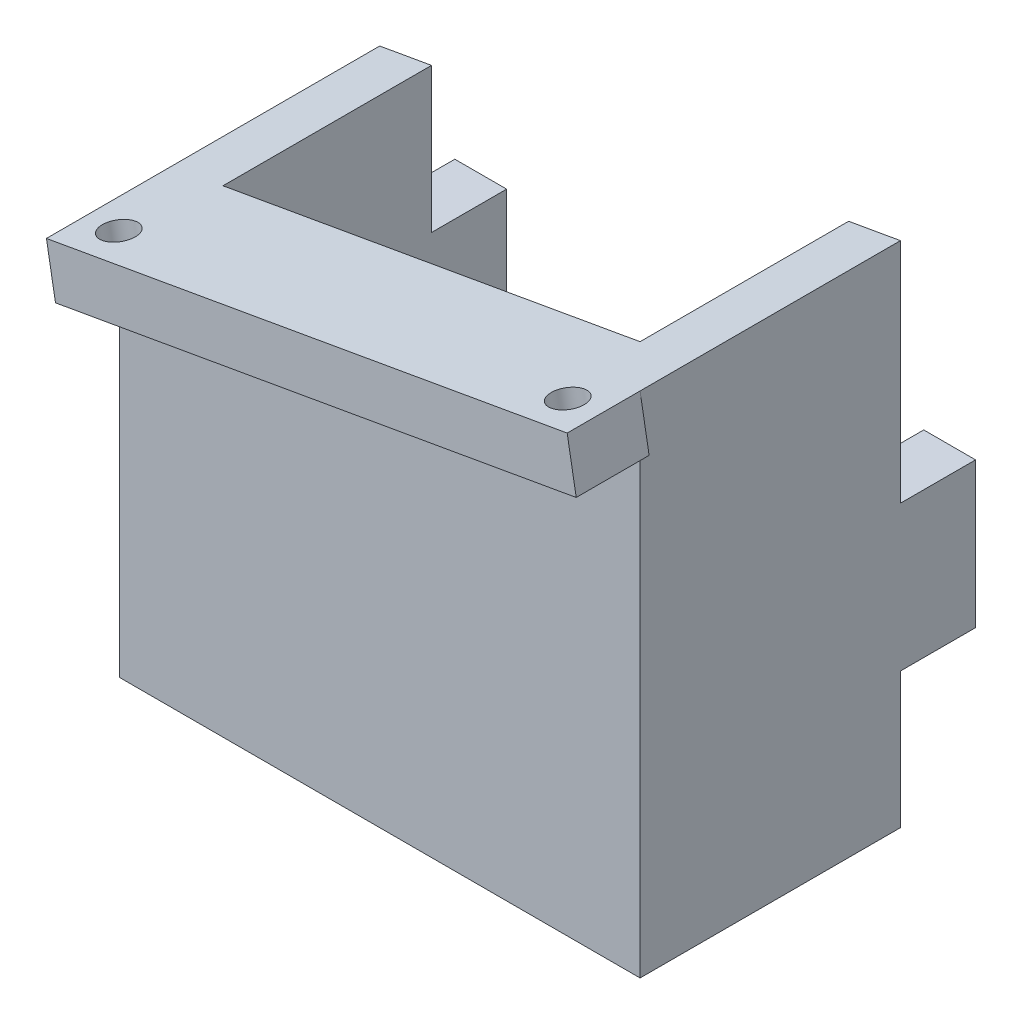
ISO-10303-21;
HEADER;
FILE_DESCRIPTION(('STEP AP214'),'2;1');
FILE_NAME('part.step','',(''),(''),'','','');
FILE_SCHEMA(('AUTOMOTIVE_DESIGN { 1 0 10303 214 1 1 1 1 }'));
ENDSEC;
DATA;
#1=APPLICATION_CONTEXT('core data for automotive mechanical design processes');
#2=APPLICATION_PROTOCOL_DEFINITION('international standard','automotive_design',2000,#1);
#3=PRODUCT_CONTEXT('',#1,'mechanical');
#4=PRODUCT('Part','Part','',(#3));
#5=PRODUCT_RELATED_PRODUCT_CATEGORY('part','',(#4));
#6=PRODUCT_DEFINITION_FORMATION('','',#4);
#7=PRODUCT_DEFINITION_CONTEXT('part definition',#1,'design');
#8=PRODUCT_DEFINITION('design','',#6,#7);
#9=PRODUCT_DEFINITION_SHAPE('','',#8);
#10=(LENGTH_UNIT() NAMED_UNIT(*) SI_UNIT(.MILLI.,.METRE.));
#11=(NAMED_UNIT(*) PLANE_ANGLE_UNIT() SI_UNIT($,.RADIAN.));
#12=(NAMED_UNIT(*) SI_UNIT($,.STERADIAN.) SOLID_ANGLE_UNIT());
#13=UNCERTAINTY_MEASURE_WITH_UNIT(LENGTH_MEASURE(1.E-05),#10,'distance_accuracy_value','');
#14=(GEOMETRIC_REPRESENTATION_CONTEXT(3) GLOBAL_UNCERTAINTY_ASSIGNED_CONTEXT((#13)) GLOBAL_UNIT_ASSIGNED_CONTEXT((#10,
#11,#12)) REPRESENTATION_CONTEXT('',''));
#15=CARTESIAN_POINT('',(0.,0.,0.));
#16=DIRECTION('',(0.,0.,1.));
#17=DIRECTION('',(1.,0.,0.));
#18=AXIS2_PLACEMENT_3D('',#15,#16,#17);
#19=CARTESIAN_POINT('',(-25.01,26.9805634136178,0.));
#20=DIRECTION('',(0.,-1.,0.));
#21=DIRECTION('',(0.,0.,-1.));
#22=AXIS2_PLACEMENT_3D('',#19,#20,#21);
#23=PLANE('',#22);
#24=DIRECTION('',(1.,0.,0.));
#25=VECTOR('',#24,1.);
#26=CARTESIAN_POINT('',(-25.01,26.9805634136178,0.));
#27=LINE('',#26,#25);
#28=CARTESIAN_POINT('',(-25.,26.9805634136178,0.));
#29=VERTEX_POINT('',#28);
#30=CARTESIAN_POINT('',(-20.025,26.9805634136178,0.));
#31=VERTEX_POINT('',#30);
#32=EDGE_CURVE('E288',#29,#31,#27,.T.);
#33=ORIENTED_EDGE('',*,*,#32,.T.);
#34=DIRECTION('',(0.,0.,-1.));
#35=VECTOR('',#34,1.);
#36=CARTESIAN_POINT('',(-20.025,26.9805634136178,20.025));
#37=LINE('',#36,#35);
#38=CARTESIAN_POINT('',(-20.025,26.9805634136178,-7.2127376350945));
#39=VERTEX_POINT('',#38);
#40=EDGE_CURVE('E297',#31,#39,#37,.T.);
#41=ORIENTED_EDGE('',*,*,#40,.T.);
#42=DIRECTION('',(1.,0.,0.));
#43=VECTOR('',#42,1.);
#44=CARTESIAN_POINT('',(-25.01,26.9805634136178,-7.2127376350945));
#45=LINE('',#44,#43);
#46=CARTESIAN_POINT('',(-25.,26.9805634136178,-7.2127376350945));
#47=VERTEX_POINT('',#46);
#48=EDGE_CURVE('E306',#47,#39,#45,.T.);
#49=ORIENTED_EDGE('',*,*,#48,.F.);
#50=DIRECTION('',(0.,0.,-1.));
#51=VECTOR('',#50,1.);
#52=CARTESIAN_POINT('',(-25.,26.9805634136178,-25.));
#53=LINE('',#52,#51);
#54=EDGE_CURVE('E41',#29,#47,#53,.T.);
#55=ORIENTED_EDGE('',*,*,#54,.F.);
#56=EDGE_LOOP('',(#33,#41,#49,#55));
#57=FACE_BOUND('',#56,.T.);
#58=ADVANCED_FACE('F37',(#57),#23,.F.);
#59=CARTESIAN_POINT('',(-25.01,26.9805634136178,-7.2127376350945));
#60=DIRECTION('',(0.,0.,1.));
#61=DIRECTION('',(1.,0.,0.));
#62=AXIS2_PLACEMENT_3D('',#59,#60,#61);
#63=PLANE('',#62);
#64=ORIENTED_EDGE('',*,*,#48,.T.);
#65=DIRECTION('',(0.,-1.,0.));
#66=VECTOR('',#65,1.);
#67=CARTESIAN_POINT('',(-20.025,110.710678118655,-7.2127376350945));
#68=LINE('',#67,#66);
#69=CARTESIAN_POINT('',(-20.025,13.0254840761523,-7.2127376350945));
#70=VERTEX_POINT('',#69);
#71=EDGE_CURVE('E295',#39,#70,#68,.T.);
#72=ORIENTED_EDGE('',*,*,#71,.T.);
#73=DIRECTION('',(1.,0.,0.));
#74=VECTOR('',#73,1.);
#75=CARTESIAN_POINT('',(-25.01,13.0254840761523,-7.2127376350945));
#76=LINE('',#75,#74);
#77=CARTESIAN_POINT('',(-25.,13.0254840761523,-7.2127376350945));
#78=VERTEX_POINT('',#77);
#79=EDGE_CURVE('E302',#78,#70,#76,.T.);
#80=ORIENTED_EDGE('',*,*,#79,.F.);
#81=DIRECTION('',(0.,-1.,0.));
#82=VECTOR('',#81,1.);
#83=CARTESIAN_POINT('',(-25.,5.,-7.2127376350945));
#84=LINE('',#83,#82);
#85=EDGE_CURVE('E346',#47,#78,#84,.T.);
#86=ORIENTED_EDGE('',*,*,#85,.F.);
#87=EDGE_LOOP('',(#64,#72,#80,#86));
#88=FACE_BOUND('',#87,.T.);
#89=ADVANCED_FACE('F421',(#88),#63,.F.);
#90=CARTESIAN_POINT('',(-25.01,13.0254840761523,-7.2127376350945));
#91=DIRECTION('',(0.,1.,0.));
#92=DIRECTION('',(0.,0.,1.));
#93=AXIS2_PLACEMENT_3D('',#90,#91,#92);
#94=PLANE('',#93);
#95=ORIENTED_EDGE('',*,*,#79,.T.);
#96=DIRECTION('',(0.,0.,1.));
#97=VECTOR('',#96,1.);
#98=CARTESIAN_POINT('',(-20.025,13.0254840761523,20.025));
#99=LINE('',#98,#97);
#100=CARTESIAN_POINT('',(-20.025,13.0254840761523,0.));
#101=VERTEX_POINT('',#100);
#102=EDGE_CURVE('E293',#70,#101,#99,.T.);
#103=ORIENTED_EDGE('',*,*,#102,.T.);
#104=DIRECTION('',(1.,0.,0.));
#105=VECTOR('',#104,1.);
#106=CARTESIAN_POINT('',(-25.01,13.0254840761523,0.));
#107=LINE('',#106,#105);
#108=CARTESIAN_POINT('',(-25.,13.0254840761523,0.));
#109=VERTEX_POINT('',#108);
#110=EDGE_CURVE('E46',#109,#101,#107,.T.);
#111=ORIENTED_EDGE('',*,*,#110,.F.);
#112=DIRECTION('',(0.,0.,1.));
#113=VECTOR('',#112,1.);
#114=CARTESIAN_POINT('',(-25.,13.0254840761523,-25.));
#115=LINE('',#114,#113);
#116=EDGE_CURVE('E333',#78,#109,#115,.T.);
#117=ORIENTED_EDGE('',*,*,#116,.F.);
#118=EDGE_LOOP('',(#95,#103,#111,#117));
#119=FACE_BOUND('',#118,.T.);
#120=ADVANCED_FACE('F426',(#119),#94,.F.);
#121=CARTESIAN_POINT('',(-25.01,13.0254840761523,0.));
#122=DIRECTION('',(0.,0.,1.));
#123=DIRECTION('',(1.,0.,0.));
#124=AXIS2_PLACEMENT_3D('',#121,#122,#123);
#125=PLANE('',#124);
#126=ORIENTED_EDGE('',*,*,#110,.T.);
#127=DIRECTION('',(0.,-1.,0.));
#128=VECTOR('',#127,1.);
#129=CARTESIAN_POINT('',(-20.025,110.710678118655,0.));
#130=LINE('',#129,#128);
#131=CARTESIAN_POINT('',(-20.025,5.,0.));
#132=VERTEX_POINT('',#131);
#133=EDGE_CURVE('E290',#101,#132,#130,.T.);
#134=ORIENTED_EDGE('',*,*,#133,.T.);
#135=DIRECTION('',(-1.,0.,0.));
#136=VECTOR('',#135,1.);
#137=CARTESIAN_POINT('',(0.,5.,0.));
#138=LINE('',#137,#136);
#139=CARTESIAN_POINT('',(-18.025,5.,0.));
#140=VERTEX_POINT('',#139);
#141=EDGE_CURVE('E322',#140,#132,#138,.T.);
#142=ORIENTED_EDGE('',*,*,#141,.F.);
#143=DIRECTION('',(0.,-1.,0.));
#144=VECTOR('',#143,1.);
#145=CARTESIAN_POINT('',(-18.025,5.,0.));
#146=LINE('',#145,#144);
#147=CARTESIAN_POINT('',(-18.025,0.,0.));
#148=VERTEX_POINT('',#147);
#149=EDGE_CURVE('E326',#140,#148,#146,.T.);
#150=ORIENTED_EDGE('',*,*,#149,.T.);
#151=DIRECTION('',(-1.,0.,0.));
#152=VECTOR('',#151,1.);
#153=CARTESIAN_POINT('',(0.,0.,0.));
#154=LINE('',#153,#152);
#155=CARTESIAN_POINT('',(-25.,0.,0.));
#156=VERTEX_POINT('',#155);
#157=EDGE_CURVE('E329',#148,#156,#154,.T.);
#158=ORIENTED_EDGE('',*,*,#157,.T.);
#159=DIRECTION('',(0.,-1.,0.));
#160=VECTOR('',#159,1.);
#161=CARTESIAN_POINT('',(-25.,5.,0.));
#162=LINE('',#161,#160);
#163=EDGE_CURVE('E315',#109,#156,#162,.T.);
#164=ORIENTED_EDGE('',*,*,#163,.F.);
#165=EDGE_LOOP('',(#126,#134,#142,#150,#158,#164));
#166=FACE_BOUND('',#165,.T.);
#167=ADVANCED_FACE('F451',(#166),#125,.F.);
#168=CARTESIAN_POINT('',(-25.01,51.2843532710014,0.));
#169=DIRECTION('',(0.,0.,1.));
#170=DIRECTION('',(1.,0.,0.));
#171=AXIS2_PLACEMENT_3D('',#168,#169,#170);
#172=PLANE('',#171);
#173=DIRECTION('',(0.984807749763281,0.17364819609251,0.));
#174=VECTOR('',#173,1.);
#175=CARTESIAN_POINT('',(-7.59424596992729,43.0691043908606,0.));
#176=LINE('',#175,#174);
#177=CARTESIAN_POINT('',(-25.,40.,0.));
#178=VERTEX_POINT('',#177);
#179=CARTESIAN_POINT('',(-20.025,40.877226825,0.));
#180=VERTEX_POINT('',#179);
#181=EDGE_CURVE('E289',#178,#180,#176,.T.);
#182=ORIENTED_EDGE('',*,*,#181,.T.);
#183=DIRECTION('',(0.,-1.,0.));
#184=VECTOR('',#183,1.);
#185=CARTESIAN_POINT('',(-20.025,110.710678118655,0.));
#186=LINE('',#185,#184);
#187=EDGE_CURVE('E54',#180,#31,#186,.T.);
#188=ORIENTED_EDGE('',*,*,#187,.T.);
#189=ORIENTED_EDGE('',*,*,#32,.F.);
#190=DIRECTION('',(0.,-1.,0.));
#191=VECTOR('',#190,1.);
#192=CARTESIAN_POINT('',(-25.,5.,0.));
#193=LINE('',#192,#191);
#194=EDGE_CURVE('E319',#178,#29,#193,.T.);
#195=ORIENTED_EDGE('',*,*,#194,.F.);
#196=EDGE_LOOP('',(#182,#188,#189,#195));
#197=FACE_BOUND('',#196,.T.);
#198=ADVANCED_FACE('F39',(#197),#172,.F.);
#199=CARTESIAN_POINT('',(20.025,26.9805634136178,0.));
#200=VERTEX_POINT('',#199);
#201=CARTESIAN_POINT('',(25.,26.9805634136178,0.));
#202=VERTEX_POINT('',#201);
#203=EDGE_CURVE('E307',#200,#202,#27,.T.);
#204=ORIENTED_EDGE('',*,*,#203,.F.);
#205=DIRECTION('',(0.,1.,0.));
#206=VECTOR('',#205,1.);
#207=CARTESIAN_POINT('',(20.025,110.710678118655,0.));
#208=LINE('',#207,#206);
#209=CARTESIAN_POINT('',(20.025,47.939123175,0.));
#210=VERTEX_POINT('',#209);
#211=EDGE_CURVE('E310',#200,#210,#208,.T.);
#212=ORIENTED_EDGE('',*,*,#211,.T.);
#213=CARTESIAN_POINT('',(25.,48.81635,0.));
#214=VERTEX_POINT('',#213);
#215=EDGE_CURVE('E62',#210,#214,#176,.T.);
#216=ORIENTED_EDGE('',*,*,#215,.T.);
#217=DIRECTION('',(0.,1.,0.));
#218=VECTOR('',#217,1.);
#219=CARTESIAN_POINT('',(25.,5.,0.));
#220=LINE('',#219,#218);
#221=EDGE_CURVE('E233',#202,#214,#220,.T.);
#222=ORIENTED_EDGE('',*,*,#221,.F.);
#223=EDGE_LOOP('',(#204,#212,#216,#222));
#224=FACE_BOUND('',#223,.T.);
#225=ADVANCED_FACE('F359',(#224),#172,.F.);
#226=CARTESIAN_POINT('',(25.,0.,0.));
#227=VERTEX_POINT('',#226);
#228=CARTESIAN_POINT('',(18.025,0.,0.));
#229=VERTEX_POINT('',#228);
#230=EDGE_CURVE('E325',#227,#229,#154,.T.);
#231=ORIENTED_EDGE('',*,*,#230,.T.);
#232=DIRECTION('',(0.,1.,0.));
#233=VECTOR('',#232,1.);
#234=CARTESIAN_POINT('',(18.025,5.,0.));
#235=LINE('',#234,#233);
#236=CARTESIAN_POINT('',(18.025,5.,0.));
#237=VERTEX_POINT('',#236);
#238=EDGE_CURVE('E313',#229,#237,#235,.T.);
#239=ORIENTED_EDGE('',*,*,#238,.T.);
#240=CARTESIAN_POINT('',(20.025,5.,0.));
#241=VERTEX_POINT('',#240);
#242=EDGE_CURVE('E323',#241,#237,#138,.T.);
#243=ORIENTED_EDGE('',*,*,#242,.F.);
#244=DIRECTION('',(0.,1.,0.));
#245=VECTOR('',#244,1.);
#246=CARTESIAN_POINT('',(20.025,110.710678118655,0.));
#247=LINE('',#246,#245);
#248=CARTESIAN_POINT('',(20.025,13.0254840761523,0.));
#249=VERTEX_POINT('',#248);
#250=EDGE_CURVE('E318',#241,#249,#247,.T.);
#251=ORIENTED_EDGE('',*,*,#250,.T.);
#252=CARTESIAN_POINT('',(25.,13.0254840761523,0.));
#253=VERTEX_POINT('',#252);
#254=EDGE_CURVE('E11',#249,#253,#107,.T.);
#255=ORIENTED_EDGE('',*,*,#254,.T.);
#256=DIRECTION('',(0.,1.,0.));
#257=VECTOR('',#256,1.);
#258=CARTESIAN_POINT('',(25.,5.,0.));
#259=LINE('',#258,#257);
#260=EDGE_CURVE('E338',#227,#253,#259,.T.);
#261=ORIENTED_EDGE('',*,*,#260,.F.);
#262=EDGE_LOOP('',(#231,#239,#243,#251,#255,#261));
#263=FACE_BOUND('',#262,.T.);
#264=ADVANCED_FACE('F445',(#263),#125,.F.);
#265=ORIENTED_EDGE('',*,*,#254,.F.);
#266=DIRECTION('',(0.,0.,-1.));
#267=VECTOR('',#266,1.);
#268=CARTESIAN_POINT('',(20.025,13.0254840761523,20.025));
#269=LINE('',#268,#267);
#270=CARTESIAN_POINT('',(20.025,13.0254840761523,-7.2127376350945));
#271=VERTEX_POINT('',#270);
#272=EDGE_CURVE('E335',#249,#271,#269,.T.);
#273=ORIENTED_EDGE('',*,*,#272,.T.);
#274=CARTESIAN_POINT('',(25.,13.0254840761523,-7.2127376350945));
#275=VERTEX_POINT('',#274);
#276=EDGE_CURVE('E299',#271,#275,#76,.T.);
#277=ORIENTED_EDGE('',*,*,#276,.T.);
#278=DIRECTION('',(0.,0.,-1.));
#279=VECTOR('',#278,1.);
#280=CARTESIAN_POINT('',(25.,13.0254840761523,-25.));
#281=LINE('',#280,#279);
#282=EDGE_CURVE('E340',#253,#275,#281,.T.);
#283=ORIENTED_EDGE('',*,*,#282,.F.);
#284=EDGE_LOOP('',(#265,#273,#277,#283));
#285=FACE_BOUND('',#284,.T.);
#286=ADVANCED_FACE('F440',(#285),#94,.F.);
#287=ORIENTED_EDGE('',*,*,#276,.F.);
#288=DIRECTION('',(0.,1.,0.));
#289=VECTOR('',#288,1.);
#290=CARTESIAN_POINT('',(20.025,110.710678118655,-7.2127376350945));
#291=LINE('',#290,#289);
#292=CARTESIAN_POINT('',(20.025,26.9805634136178,-7.2127376350945));
#293=VERTEX_POINT('',#292);
#294=EDGE_CURVE('E342',#271,#293,#291,.T.);
#295=ORIENTED_EDGE('',*,*,#294,.T.);
#296=CARTESIAN_POINT('',(25.,26.9805634136178,-7.2127376350945));
#297=VERTEX_POINT('',#296);
#298=EDGE_CURVE('E303',#293,#297,#45,.T.);
#299=ORIENTED_EDGE('',*,*,#298,.T.);
#300=DIRECTION('',(0.,1.,0.));
#301=VECTOR('',#300,1.);
#302=CARTESIAN_POINT('',(25.,5.,-7.2127376350945));
#303=LINE('',#302,#301);
#304=EDGE_CURVE('E344',#275,#297,#303,.T.);
#305=ORIENTED_EDGE('',*,*,#304,.F.);
#306=EDGE_LOOP('',(#287,#295,#299,#305));
#307=FACE_BOUND('',#306,.T.);
#308=ADVANCED_FACE('F429',(#307),#63,.F.);
#309=ORIENTED_EDGE('',*,*,#298,.F.);
#310=DIRECTION('',(0.,0.,1.));
#311=VECTOR('',#310,1.);
#312=CARTESIAN_POINT('',(20.025,26.9805634136178,20.025));
#313=LINE('',#312,#311);
#314=EDGE_CURVE('E312',#293,#200,#313,.T.);
#315=ORIENTED_EDGE('',*,*,#314,.T.);
#316=ORIENTED_EDGE('',*,*,#203,.T.);
#317=DIRECTION('',(0.,0.,1.));
#318=VECTOR('',#317,1.);
#319=CARTESIAN_POINT('',(25.,26.9805634136178,-25.));
#320=LINE('',#319,#318);
#321=EDGE_CURVE('E316',#297,#202,#320,.T.);
#322=ORIENTED_EDGE('',*,*,#321,.F.);
#323=EDGE_LOOP('',(#309,#315,#316,#322));
#324=FACE_BOUND('',#323,.T.);
#325=ADVANCED_FACE('F356',(#324),#23,.F.);
#326=CARTESIAN_POINT('',(0.,5.,0.));
#327=DIRECTION('',(0.,-1.,0.));
#328=DIRECTION('',(0.,0.,-1.));
#329=AXIS2_PLACEMENT_3D('',#326,#327,#328);
#330=PLANE('',#329);
#331=DIRECTION('',(0.,0.,-1.));
#332=VECTOR('',#331,1.);
#333=CARTESIAN_POINT('',(20.025,5.,0.));
#334=LINE('',#333,#332);
#335=CARTESIAN_POINT('',(20.025,5.,20.025));
#336=VERTEX_POINT('',#335);
#337=EDGE_CURVE('E253',#336,#241,#334,.T.);
#338=ORIENTED_EDGE('',*,*,#337,.T.);
#339=ORIENTED_EDGE('',*,*,#242,.T.);
#340=DIRECTION('',(0.,0.,-1.));
#341=VECTOR('',#340,1.);
#342=CARTESIAN_POINT('',(18.025,5.,-18.025));
#343=LINE('',#342,#341);
#344=CARTESIAN_POINT('',(18.025,5.,18.025));
#345=VERTEX_POINT('',#344);
#346=EDGE_CURVE('E262',#345,#237,#343,.T.);
#347=ORIENTED_EDGE('',*,*,#346,.F.);
#348=DIRECTION('',(1.,0.,0.));
#349=VECTOR('',#348,1.);
#350=CARTESIAN_POINT('',(18.025,5.,18.025));
#351=LINE('',#350,#349);
#352=CARTESIAN_POINT('',(-18.025,5.,18.025));
#353=VERTEX_POINT('',#352);
#354=EDGE_CURVE('E259',#353,#345,#351,.T.);
#355=ORIENTED_EDGE('',*,*,#354,.F.);
#356=DIRECTION('',(0.,0.,1.));
#357=VECTOR('',#356,1.);
#358=CARTESIAN_POINT('',(-18.025,5.,-18.025));
#359=LINE('',#358,#357);
#360=EDGE_CURVE('E257',#140,#353,#359,.T.);
#361=ORIENTED_EDGE('',*,*,#360,.F.);
#362=ORIENTED_EDGE('',*,*,#141,.T.);
#363=DIRECTION('',(0.,0.,1.));
#364=VECTOR('',#363,1.);
#365=CARTESIAN_POINT('',(-20.025,5.,0.));
#366=LINE('',#365,#364);
#367=CARTESIAN_POINT('',(-20.025,5.,20.025));
#368=VERTEX_POINT('',#367);
#369=EDGE_CURVE('E248',#132,#368,#366,.T.);
#370=ORIENTED_EDGE('',*,*,#369,.T.);
#371=DIRECTION('',(1.,0.,0.));
#372=VECTOR('',#371,1.);
#373=CARTESIAN_POINT('',(0.,5.,20.025));
#374=LINE('',#373,#372);
#375=EDGE_CURVE('E250',#368,#336,#374,.T.);
#376=ORIENTED_EDGE('',*,*,#375,.T.);
#377=EDGE_LOOP('',(#338,#339,#347,#355,#361,#362,#370,#376));
#378=FACE_BOUND('',#377,.T.);
#379=ADVANCED_FACE('F432',(#378),#330,.F.);
#380=CARTESIAN_POINT('',(0.,0.,0.));
#381=DIRECTION('',(0.,-1.,0.));
#382=DIRECTION('',(0.,0.,-1.));
#383=AXIS2_PLACEMENT_3D('',#380,#381,#382);
#384=PLANE('',#383);
#385=ORIENTED_EDGE('',*,*,#230,.F.);
#386=DIRECTION('',(0.,0.,-1.));
#387=VECTOR('',#386,1.);
#388=CARTESIAN_POINT('',(25.,0.,-25.));
#389=LINE('',#388,#387);
#390=CARTESIAN_POINT('',(25.,0.,25.));
#391=VERTEX_POINT('',#390);
#392=EDGE_CURVE('E281',#391,#227,#389,.T.);
#393=ORIENTED_EDGE('',*,*,#392,.F.);
#394=DIRECTION('',(1.,0.,0.));
#395=VECTOR('',#394,1.);
#396=CARTESIAN_POINT('',(25.,0.,25.));
#397=LINE('',#396,#395);
#398=CARTESIAN_POINT('',(-25.,0.,25.));
#399=VERTEX_POINT('',#398);
#400=EDGE_CURVE('E278',#399,#391,#397,.T.);
#401=ORIENTED_EDGE('',*,*,#400,.F.);
#402=DIRECTION('',(0.,0.,1.));
#403=VECTOR('',#402,1.);
#404=CARTESIAN_POINT('',(-25.,0.,-25.));
#405=LINE('',#404,#403);
#406=EDGE_CURVE('E276',#156,#399,#405,.T.);
#407=ORIENTED_EDGE('',*,*,#406,.F.);
#408=ORIENTED_EDGE('',*,*,#157,.F.);
#409=DIRECTION('',(0.,0.,1.));
#410=VECTOR('',#409,1.);
#411=CARTESIAN_POINT('',(-18.025,0.,-18.025));
#412=LINE('',#411,#410);
#413=CARTESIAN_POINT('',(-18.025,0.,18.025));
#414=VERTEX_POINT('',#413);
#415=EDGE_CURVE('E256',#148,#414,#412,.T.);
#416=ORIENTED_EDGE('',*,*,#415,.T.);
#417=DIRECTION('',(1.,0.,0.));
#418=VECTOR('',#417,1.);
#419=CARTESIAN_POINT('',(18.025,0.,18.025));
#420=LINE('',#419,#418);
#421=CARTESIAN_POINT('',(18.025,0.,18.025));
#422=VERTEX_POINT('',#421);
#423=EDGE_CURVE('E267',#414,#422,#420,.T.);
#424=ORIENTED_EDGE('',*,*,#423,.T.);
#425=DIRECTION('',(0.,0.,-1.));
#426=VECTOR('',#425,1.);
#427=CARTESIAN_POINT('',(18.025,0.,-18.025));
#428=LINE('',#427,#426);
#429=EDGE_CURVE('E260',#422,#229,#428,.T.);
#430=ORIENTED_EDGE('',*,*,#429,.T.);
#431=EDGE_LOOP('',(#385,#393,#401,#407,#408,#416,#424,#430));
#432=FACE_BOUND('',#431,.T.);
#433=ADVANCED_FACE('F437',(#432),#384,.T.);
#434=CARTESIAN_POINT('',(-25.,5.,-25.));
#435=DIRECTION('',(1.,0.,0.));
#436=DIRECTION('',(0.,0.,-1.));
#437=AXIS2_PLACEMENT_3D('',#434,#435,#436);
#438=PLANE('',#437);
#439=DIRECTION('',(0.,0.,1.));
#440=VECTOR('',#439,1.);
#441=CARTESIAN_POINT('',(-25.,40.,25.));
#442=LINE('',#441,#440);
#443=CARTESIAN_POINT('',(-25.,40.,25.));
#444=VERTEX_POINT('',#443);
#445=EDGE_CURVE('E234',#178,#444,#442,.T.);
#446=ORIENTED_EDGE('',*,*,#445,.F.);
#447=ORIENTED_EDGE('',*,*,#194,.T.);
#448=ORIENTED_EDGE('',*,*,#54,.T.);
#449=ORIENTED_EDGE('',*,*,#85,.T.);
#450=ORIENTED_EDGE('',*,*,#116,.T.);
#451=ORIENTED_EDGE('',*,*,#163,.T.);
#452=ORIENTED_EDGE('',*,*,#406,.T.);
#453=DIRECTION('',(0.,-1.,0.));
#454=VECTOR('',#453,1.);
#455=CARTESIAN_POINT('',(-25.,5.,25.));
#456=LINE('',#455,#454);
#457=EDGE_CURVE('E208',#444,#399,#456,.T.);
#458=ORIENTED_EDGE('',*,*,#457,.F.);
#459=EDGE_LOOP('',(#446,#447,#448,#449,#450,#451,#452,#458));
#460=FACE_BOUND('',#459,.T.);
#461=ADVANCED_FACE('F456',(#460),#438,.F.);
#462=CARTESIAN_POINT('',(25.,5.,25.));
#463=DIRECTION('',(0.,0.,-1.));
#464=DIRECTION('',(-1.,0.,0.));
#465=AXIS2_PLACEMENT_3D('',#462,#463,#464);
#466=PLANE('',#465);
#467=DIRECTION('',(0.,-1.,0.));
#468=VECTOR('',#467,1.);
#469=CARTESIAN_POINT('',(25.,5.,25.));
#470=LINE('',#469,#468);
#471=CARTESIAN_POINT('',(25.,43.7392169238216,25.));
#472=VERTEX_POINT('',#471);
#473=EDGE_CURVE('E209',#472,#391,#470,.T.);
#474=ORIENTED_EDGE('',*,*,#473,.F.);
#475=DIRECTION('',(-0.984807749763281,-0.17364819609251,0.));
#476=VECTOR('',#475,1.);
#477=CARTESIAN_POINT('',(-24.1317590195375,35.0759612511836,25.));
#478=LINE('',#477,#476);
#479=CARTESIAN_POINT('',(-24.1317590195375,35.0759612511836,25.));
#480=VERTEX_POINT('',#479);
#481=EDGE_CURVE('E286',#472,#480,#478,.T.);
#482=ORIENTED_EDGE('',*,*,#481,.T.);
#483=DIRECTION('',(-0.17364819609251,0.984807749763281,0.));
#484=VECTOR('',#483,1.);
#485=CARTESIAN_POINT('',(-24.1317590195375,35.0759612511836,25.));
#486=LINE('',#485,#484);
#487=EDGE_CURVE('E377',#480,#444,#486,.T.);
#488=ORIENTED_EDGE('',*,*,#487,.T.);
#489=ORIENTED_EDGE('',*,*,#457,.T.);
#490=ORIENTED_EDGE('',*,*,#400,.T.);
#491=EDGE_LOOP('',(#474,#482,#488,#489,#490));
#492=FACE_BOUND('',#491,.T.);
#493=ADVANCED_FACE('F459',(#492),#466,.F.);
#494=CARTESIAN_POINT('',(25.,5.,-25.));
#495=DIRECTION('',(-1.,0.,0.));
#496=DIRECTION('',(0.,0.,1.));
#497=AXIS2_PLACEMENT_3D('',#494,#495,#496);
#498=PLANE('',#497);
#499=ORIENTED_EDGE('',*,*,#321,.T.);
#500=ORIENTED_EDGE('',*,*,#221,.T.);
#501=DIRECTION('',(0.,0.,-1.));
#502=VECTOR('',#501,1.);
#503=CARTESIAN_POINT('',(25.,48.81635,25.));
#504=LINE('',#503,#502);
#505=CARTESIAN_POINT('',(25.,48.81635,25.));
#506=VERTEX_POINT('',#505);
#507=EDGE_CURVE('E226',#506,#214,#504,.T.);
#508=ORIENTED_EDGE('',*,*,#507,.F.);
#509=EDGE_CURVE('E199',#506,#472,#470,.T.);
#510=ORIENTED_EDGE('',*,*,#509,.T.);
#511=ORIENTED_EDGE('',*,*,#473,.T.);
#512=ORIENTED_EDGE('',*,*,#392,.T.);
#513=ORIENTED_EDGE('',*,*,#260,.T.);
#514=ORIENTED_EDGE('',*,*,#282,.T.);
#515=ORIENTED_EDGE('',*,*,#304,.T.);
#516=EDGE_LOOP('',(#499,#500,#508,#510,#511,#512,#513,#514,#515));
#517=FACE_BOUND('',#516,.T.);
#518=ADVANCED_FACE('F232',(#517),#498,.F.);
#519=CARTESIAN_POINT('',(-18.025,5.,-18.025));
#520=DIRECTION('',(1.,0.,0.));
#521=DIRECTION('',(0.,0.,-1.));
#522=AXIS2_PLACEMENT_3D('',#519,#520,#521);
#523=PLANE('',#522);
#524=ORIENTED_EDGE('',*,*,#149,.F.);
#525=ORIENTED_EDGE('',*,*,#360,.T.);
#526=DIRECTION('',(0.,-1.,0.));
#527=VECTOR('',#526,1.);
#528=CARTESIAN_POINT('',(-18.025,5.,18.025));
#529=LINE('',#528,#527);
#530=EDGE_CURVE('E273',#353,#414,#529,.T.);
#531=ORIENTED_EDGE('',*,*,#530,.T.);
#532=ORIENTED_EDGE('',*,*,#415,.F.);
#533=EDGE_LOOP('',(#524,#525,#531,#532));
#534=FACE_BOUND('',#533,.T.);
#535=ADVANCED_FACE('F466',(#534),#523,.T.);
#536=CARTESIAN_POINT('',(18.025,5.,18.025));
#537=DIRECTION('',(0.,0.,-1.));
#538=DIRECTION('',(-1.,0.,0.));
#539=AXIS2_PLACEMENT_3D('',#536,#537,#538);
#540=PLANE('',#539);
#541=ORIENTED_EDGE('',*,*,#423,.F.);
#542=ORIENTED_EDGE('',*,*,#530,.F.);
#543=ORIENTED_EDGE('',*,*,#354,.T.);
#544=DIRECTION('',(0.,-1.,0.));
#545=VECTOR('',#544,1.);
#546=CARTESIAN_POINT('',(18.025,5.,18.025));
#547=LINE('',#546,#545);
#548=EDGE_CURVE('E265',#345,#422,#547,.T.);
#549=ORIENTED_EDGE('',*,*,#548,.T.);
#550=EDGE_LOOP('',(#541,#542,#543,#549));
#551=FACE_BOUND('',#550,.T.);
#552=ADVANCED_FACE('F472',(#551),#540,.T.);
#553=CARTESIAN_POINT('',(18.025,5.,-18.025));
#554=DIRECTION('',(-1.,0.,0.));
#555=DIRECTION('',(0.,0.,1.));
#556=AXIS2_PLACEMENT_3D('',#553,#554,#555);
#557=PLANE('',#556);
#558=ORIENTED_EDGE('',*,*,#238,.F.);
#559=ORIENTED_EDGE('',*,*,#429,.F.);
#560=ORIENTED_EDGE('',*,*,#548,.F.);
#561=ORIENTED_EDGE('',*,*,#346,.T.);
#562=EDGE_LOOP('',(#558,#559,#560,#561));
#563=FACE_BOUND('',#562,.T.);
#564=ADVANCED_FACE('F476',(#563),#557,.T.);
#565=CARTESIAN_POINT('',(20.025,110.710678118655,20.025));
#566=DIRECTION('',(-1.,0.,0.));
#567=DIRECTION('',(0.,0.,1.));
#568=AXIS2_PLACEMENT_3D('',#565,#566,#567);
#569=PLANE('',#568);
#570=ORIENTED_EDGE('',*,*,#211,.F.);
#571=ORIENTED_EDGE('',*,*,#314,.F.);
#572=ORIENTED_EDGE('',*,*,#294,.F.);
#573=ORIENTED_EDGE('',*,*,#272,.F.);
#574=ORIENTED_EDGE('',*,*,#250,.F.);
#575=ORIENTED_EDGE('',*,*,#337,.F.);
#576=DIRECTION('',(0.,-1.,0.));
#577=VECTOR('',#576,1.);
#578=CARTESIAN_POINT('',(20.025,110.710678118655,20.025));
#579=LINE('',#578,#577);
#580=CARTESIAN_POINT('',(20.025,47.939123175,20.025));
#581=VERTEX_POINT('',#580);
#582=EDGE_CURVE('E237',#581,#336,#579,.T.);
#583=ORIENTED_EDGE('',*,*,#582,.F.);
#584=DIRECTION('',(0.,0.,-1.));
#585=VECTOR('',#584,1.);
#586=CARTESIAN_POINT('',(20.025,47.939123175,20.025));
#587=LINE('',#586,#585);
#588=EDGE_CURVE('E362',#581,#210,#587,.T.);
#589=ORIENTED_EDGE('',*,*,#588,.T.);
#590=EDGE_LOOP('',(#570,#571,#572,#573,#574,#575,#583,#589));
#591=FACE_BOUND('',#590,.T.);
#592=ADVANCED_FACE('F363',(#591),#569,.T.);
#593=CARTESIAN_POINT('',(20.025,110.710678118655,20.025));
#594=DIRECTION('',(0.,0.,-1.));
#595=DIRECTION('',(-1.,0.,0.));
#596=AXIS2_PLACEMENT_3D('',#593,#594,#595);
#597=PLANE('',#596);
#598=ORIENTED_EDGE('',*,*,#375,.F.);
#599=DIRECTION('',(0.,-1.,0.));
#600=VECTOR('',#599,1.);
#601=CARTESIAN_POINT('',(-20.025,110.710678118655,20.025));
#602=LINE('',#601,#600);
#603=CARTESIAN_POINT('',(-20.025,40.877226825,20.025));
#604=VERTEX_POINT('',#603);
#605=EDGE_CURVE('E245',#604,#368,#602,.T.);
#606=ORIENTED_EDGE('',*,*,#605,.F.);
#607=DIRECTION('',(0.984807749763281,0.17364819609251,0.));
#608=VECTOR('',#607,1.);
#609=CARTESIAN_POINT('',(31.6066827751661,49.9812865536967,20.025));
#610=LINE('',#609,#608);
#611=EDGE_CURVE('E239',#604,#581,#610,.T.);
#612=ORIENTED_EDGE('',*,*,#611,.T.);
#613=ORIENTED_EDGE('',*,*,#582,.T.);
#614=EDGE_LOOP('',(#598,#606,#612,#613));
#615=FACE_BOUND('',#614,.T.);
#616=ADVANCED_FACE('F483',(#615),#597,.T.);
#617=CARTESIAN_POINT('',(-20.025,110.710678118655,20.025));
#618=DIRECTION('',(1.,0.,0.));
#619=DIRECTION('',(0.,0.,-1.));
#620=AXIS2_PLACEMENT_3D('',#617,#618,#619);
#621=PLANE('',#620);
#622=ORIENTED_EDGE('',*,*,#187,.F.);
#623=DIRECTION('',(0.,0.,1.));
#624=VECTOR('',#623,1.);
#625=CARTESIAN_POINT('',(-20.025,40.877226825,20.025));
#626=LINE('',#625,#624);
#627=EDGE_CURVE('E235',#180,#604,#626,.T.);
#628=ORIENTED_EDGE('',*,*,#627,.T.);
#629=ORIENTED_EDGE('',*,*,#605,.T.);
#630=ORIENTED_EDGE('',*,*,#369,.F.);
#631=ORIENTED_EDGE('',*,*,#133,.F.);
#632=ORIENTED_EDGE('',*,*,#102,.F.);
#633=ORIENTED_EDGE('',*,*,#71,.F.);
#634=ORIENTED_EDGE('',*,*,#40,.F.);
#635=EDGE_LOOP('',(#622,#628,#629,#630,#631,#632,#633,#634));
#636=FACE_BOUND('',#635,.T.);
#637=ADVANCED_FACE('F400',(#636),#621,.T.);
#638=CARTESIAN_POINT('',(-7.59424596992729,43.0691043908606,0.));
#639=DIRECTION('',(-0.17364819609251,0.984807749763281,0.));
#640=DIRECTION('',(-0.984807749763281,-0.17364819609251,0.));
#641=AXIS2_PLACEMENT_3D('',#638,#639,#640);
#642=PLANE('',#641);
#643=ORIENTED_EDGE('',*,*,#181,.F.);
#644=ORIENTED_EDGE('',*,*,#445,.T.);
#645=DIRECTION('',(0.,0.,1.));
#646=VECTOR('',#645,1.);
#647=CARTESIAN_POINT('',(-25.,40.,25.));
#648=LINE('',#647,#646);
#649=CARTESIAN_POINT('',(-25.,40.,32.));
#650=VERTEX_POINT('',#649);
#651=EDGE_CURVE('E366',#444,#650,#648,.T.);
#652=ORIENTED_EDGE('',*,*,#651,.T.);
#653=DIRECTION('',(0.984807749763281,0.17364819609251,0.));
#654=VECTOR('',#653,1.);
#655=CARTESIAN_POINT('',(-25.,40.,32.));
#656=LINE('',#655,#654);
#657=CARTESIAN_POINT('',(25.,48.81635,32.));
#658=VERTEX_POINT('',#657);
#659=EDGE_CURVE('E229',#650,#658,#656,.T.);
#660=ORIENTED_EDGE('',*,*,#659,.T.);
#661=DIRECTION('',(0.,0.,-1.));
#662=VECTOR('',#661,1.);
#663=CARTESIAN_POINT('',(25.,48.81635,25.));
#664=LINE('',#663,#662);
#665=EDGE_CURVE('E216',#658,#506,#664,.T.);
#666=ORIENTED_EDGE('',*,*,#665,.T.);
#667=ORIENTED_EDGE('',*,*,#507,.T.);
#668=ORIENTED_EDGE('',*,*,#215,.F.);
#669=ORIENTED_EDGE('',*,*,#588,.F.);
#670=ORIENTED_EDGE('',*,*,#611,.F.);
#671=ORIENTED_EDGE('',*,*,#627,.F.);
#672=EDGE_LOOP('',(#643,#644,#652,#660,#666,#667,#668,#669,#670,#671));
#673=FACE_BOUND('',#672,.T.);
#674=CARTESIAN_POINT('',(21.5531728758285,48.2085813136762,28.5));
#675=DIRECTION('',(-0.17364819609251,0.984807749763281,0.));
#676=DIRECTION('',(0.984807749763281,0.17364819609251,0.));
#677=AXIS2_PLACEMENT_3D('',#674,#675,#676);
#678=CIRCLE('',#677,1.6);
#679=CARTESIAN_POINT('',(23.1288652754497,48.4864184274242,28.5));
#680=VERTEX_POINT('',#679);
#681=EDGE_CURVE('E388',#680,#680,#678,.T.);
#682=ORIENTED_EDGE('',*,*,#681,.F.);
#683=EDGE_LOOP('',(#682));
#684=FACE_BOUND('',#683,.T.);
#685=CARTESIAN_POINT('',(-21.5531728758285,40.6077686863238,28.5));
#686=DIRECTION('',(-0.17364819609251,0.984807749763281,0.));
#687=DIRECTION('',(-0.984807749763281,-0.17364819609251,0.));
#688=AXIS2_PLACEMENT_3D('',#685,#686,#687);
#689=CIRCLE('',#688,1.60000000000001);
#690=CARTESIAN_POINT('',(-23.1288652754498,40.3299315725758,28.5));
#691=VERTEX_POINT('',#690);
#692=EDGE_CURVE('E385',#691,#691,#689,.T.);
#693=ORIENTED_EDGE('',*,*,#692,.F.);
#694=EDGE_LOOP('',(#693));
#695=FACE_BOUND('',#694,.T.);
#696=ADVANCED_FACE('F224',(#673,#684,#695),#642,.T.);
#697=CARTESIAN_POINT('',(-24.1317590195375,35.0759612511836,25.));
#698=DIRECTION('',(0.,0.,-1.));
#699=DIRECTION('',(0.,1.,0.));
#700=AXIS2_PLACEMENT_3D('',#697,#698,#699);
#701=PLANE('',#700);
#702=ORIENTED_EDGE('',*,*,#509,.F.);
#703=DIRECTION('',(-0.17364819609251,0.984807749763281,0.));
#704=VECTOR('',#703,1.);
#705=CARTESIAN_POINT('',(25.8682409804625,43.8923112511836,25.));
#706=LINE('',#705,#704);
#707=CARTESIAN_POINT('',(25.8682409804625,43.8923112511836,25.));
#708=VERTEX_POINT('',#707);
#709=EDGE_CURVE('E202',#708,#506,#706,.T.);
#710=ORIENTED_EDGE('',*,*,#709,.F.);
#711=EDGE_CURVE('E204',#708,#472,#478,.T.);
#712=ORIENTED_EDGE('',*,*,#711,.T.);
#713=EDGE_LOOP('',(#702,#710,#712));
#714=FACE_BOUND('',#713,.T.);
#715=ADVANCED_FACE('F201',(#714),#701,.T.);
#716=CARTESIAN_POINT('',(25.8682409804625,43.8923112511836,25.));
#717=DIRECTION('',(0.984807749763281,0.17364819609251,0.));
#718=DIRECTION('',(-0.17364819609251,0.984807749763281,0.));
#719=AXIS2_PLACEMENT_3D('',#716,#717,#718);
#720=PLANE('',#719);
#721=ORIENTED_EDGE('',*,*,#665,.F.);
#722=DIRECTION('',(-0.17364819609251,0.984807749763281,0.));
#723=VECTOR('',#722,1.);
#724=CARTESIAN_POINT('',(25.8682409804625,43.8923112511836,32.));
#725=LINE('',#724,#723);
#726=CARTESIAN_POINT('',(25.8682409804625,43.8923112511836,32.));
#727=VERTEX_POINT('',#726);
#728=EDGE_CURVE('E219',#727,#658,#725,.T.);
#729=ORIENTED_EDGE('',*,*,#728,.F.);
#730=DIRECTION('',(0.,0.,-1.));
#731=VECTOR('',#730,1.);
#732=CARTESIAN_POINT('',(25.8682409804625,43.8923112511836,25.));
#733=LINE('',#732,#731);
#734=EDGE_CURVE('E218',#727,#708,#733,.T.);
#735=ORIENTED_EDGE('',*,*,#734,.T.);
#736=ORIENTED_EDGE('',*,*,#709,.T.);
#737=EDGE_LOOP('',(#721,#729,#735,#736));
#738=FACE_BOUND('',#737,.T.);
#739=ADVANCED_FACE('F215',(#738),#720,.T.);
#740=CARTESIAN_POINT('',(-24.1317590195375,35.0759612511836,32.));
#741=DIRECTION('',(0.,0.,1.));
#742=DIRECTION('',(1.,0.,0.));
#743=AXIS2_PLACEMENT_3D('',#740,#741,#742);
#744=PLANE('',#743);
#745=ORIENTED_EDGE('',*,*,#659,.F.);
#746=DIRECTION('',(-0.17364819609251,0.984807749763281,0.));
#747=VECTOR('',#746,1.);
#748=CARTESIAN_POINT('',(-24.1317590195375,35.0759612511836,32.));
#749=LINE('',#748,#747);
#750=CARTESIAN_POINT('',(-24.1317590195375,35.0759612511836,32.));
#751=VERTEX_POINT('',#750);
#752=EDGE_CURVE('E381',#751,#650,#749,.T.);
#753=ORIENTED_EDGE('',*,*,#752,.F.);
#754=DIRECTION('',(0.984807749763281,0.17364819609251,0.));
#755=VECTOR('',#754,1.);
#756=CARTESIAN_POINT('',(-24.1317590195375,35.0759612511836,32.));
#757=LINE('',#756,#755);
#758=EDGE_CURVE('E374',#751,#727,#757,.T.);
#759=ORIENTED_EDGE('',*,*,#758,.T.);
#760=ORIENTED_EDGE('',*,*,#728,.T.);
#761=EDGE_LOOP('',(#745,#753,#759,#760));
#762=FACE_BOUND('',#761,.T.);
#763=ADVANCED_FACE('F491',(#762),#744,.T.);
#764=CARTESIAN_POINT('',(-24.1317590195375,35.0759612511836,25.));
#765=DIRECTION('',(-0.984807749763281,-0.17364819609251,0.));
#766=DIRECTION('',(0.17364819609251,-0.984807749763281,0.));
#767=AXIS2_PLACEMENT_3D('',#764,#765,#766);
#768=PLANE('',#767);
#769=ORIENTED_EDGE('',*,*,#651,.F.);
#770=ORIENTED_EDGE('',*,*,#487,.F.);
#771=DIRECTION('',(0.,0.,1.));
#772=VECTOR('',#771,1.);
#773=CARTESIAN_POINT('',(-24.1317590195375,35.0759612511836,25.));
#774=LINE('',#773,#772);
#775=EDGE_CURVE('E371',#480,#751,#774,.T.);
#776=ORIENTED_EDGE('',*,*,#775,.T.);
#777=ORIENTED_EDGE('',*,*,#752,.T.);
#778=EDGE_LOOP('',(#769,#770,#776,#777));
#779=FACE_BOUND('',#778,.T.);
#780=ADVANCED_FACE('F415',(#779),#768,.T.);
#781=CARTESIAN_POINT('',(-6.72600498946474,38.1450656420443,0.));
#782=DIRECTION('',(0.17364819609251,-0.984807749763281,0.));
#783=DIRECTION('',(0.984807749763281,0.17364819609251,0.));
#784=AXIS2_PLACEMENT_3D('',#781,#782,#783);
#785=PLANE('',#784);
#786=CARTESIAN_POINT('',(22.421413856291,43.2845425648598,28.5));
#787=DIRECTION('',(-0.17364819609251,0.984807749763281,0.));
#788=DIRECTION('',(0.984807749763281,0.17364819609251,0.));
#789=AXIS2_PLACEMENT_3D('',#786,#787,#788);
#790=CIRCLE('',#789,1.6);
#791=CARTESIAN_POINT('',(23.9971062559123,43.5623796786078,28.5));
#792=VERTEX_POINT('',#791);
#793=EDGE_CURVE('E391',#792,#792,#790,.T.);
#794=ORIENTED_EDGE('',*,*,#793,.T.);
#795=EDGE_LOOP('',(#794));
#796=FACE_BOUND('',#795,.T.);
#797=CARTESIAN_POINT('',(-20.684931895366,35.6837299375074,28.5));
#798=DIRECTION('',(-0.17364819609251,0.984807749763281,0.));
#799=DIRECTION('',(-0.984807749763281,-0.17364819609251,0.));
#800=AXIS2_PLACEMENT_3D('',#797,#798,#799);
#801=CIRCLE('',#800,1.60000000000001);
#802=CARTESIAN_POINT('',(-22.2606242949872,35.4058928237594,28.5));
#803=VERTEX_POINT('',#802);
#804=EDGE_CURVE('E220',#803,#803,#801,.T.);
#805=ORIENTED_EDGE('',*,*,#804,.T.);
#806=EDGE_LOOP('',(#805));
#807=FACE_BOUND('',#806,.T.);
#808=ORIENTED_EDGE('',*,*,#711,.F.);
#809=ORIENTED_EDGE('',*,*,#734,.F.);
#810=ORIENTED_EDGE('',*,*,#758,.F.);
#811=ORIENTED_EDGE('',*,*,#775,.F.);
#812=ORIENTED_EDGE('',*,*,#481,.F.);
#813=EDGE_LOOP('',(#808,#809,#810,#811,#812));
#814=FACE_BOUND('',#813,.T.);
#815=ADVANCED_FACE('F406',(#796,#807,#814),#785,.T.);
#816=CARTESIAN_POINT('',(-20.684931895366,35.6837299375074,28.5));
#817=DIRECTION('',(-0.17364819609251,0.984807749763281,0.));
#818=DIRECTION('',(-0.984807749763281,-0.17364819609251,0.));
#819=AXIS2_PLACEMENT_3D('',#816,#817,#818);
#820=CYLINDRICAL_SURFACE('',#819,1.60000000000001);
#821=ORIENTED_EDGE('',*,*,#804,.F.);
#822=EDGE_LOOP('',(#821));
#823=FACE_BOUND('',#822,.T.);
#824=ORIENTED_EDGE('',*,*,#692,.T.);
#825=EDGE_LOOP('',(#824));
#826=FACE_BOUND('',#825,.T.);
#827=ADVANCED_FACE('F404',(#823,#826),#820,.F.);
#828=CARTESIAN_POINT('',(22.421413856291,43.2845425648598,28.5));
#829=DIRECTION('',(-0.17364819609251,0.984807749763281,0.));
#830=DIRECTION('',(-0.984807749763281,-0.17364819609251,0.));
#831=AXIS2_PLACEMENT_3D('',#828,#829,#830);
#832=CYLINDRICAL_SURFACE('',#831,1.6);
#833=ORIENTED_EDGE('',*,*,#793,.F.);
#834=EDGE_LOOP('',(#833));
#835=FACE_BOUND('',#834,.T.);
#836=ORIENTED_EDGE('',*,*,#681,.T.);
#837=EDGE_LOOP('',(#836));
#838=FACE_BOUND('',#837,.T.);
#839=ADVANCED_FACE('F397',(#835,#838),#832,.F.);
#840=CLOSED_SHELL('',(#58,#89,#120,#167,#198,#225,#264,#286,#308,#325,#379,#433,#461,#493,#518,
#535,#552,#564,#592,#616,#637,#696,#715,#739,#763,#780,#815,#827,#839));
#841=MANIFOLD_SOLID_BREP('B2',#840);
#842=ADVANCED_BREP_SHAPE_REPRESENTATION('',(#18,#841),#14);
#843=SHAPE_DEFINITION_REPRESENTATION(#9,#842);
ENDSEC;
END-ISO-10303-21;
